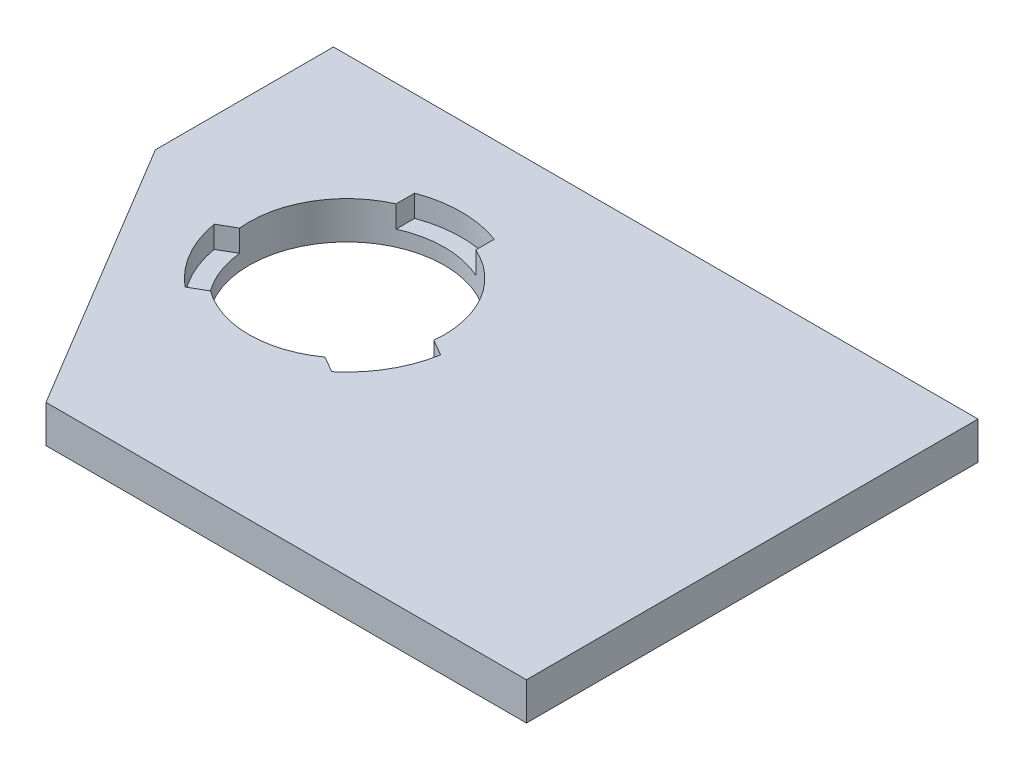
ISO-10303-21;
HEADER;
FILE_DESCRIPTION(('STEP AP214'),'2;1');
FILE_NAME('part.step','',(''),(''),'','','');
FILE_SCHEMA(('AUTOMOTIVE_DESIGN { 1 0 10303 214 1 1 1 1 }'));
ENDSEC;
DATA;
#1=APPLICATION_CONTEXT('core data for automotive mechanical design processes');
#2=APPLICATION_PROTOCOL_DEFINITION('international standard','automotive_design',2000,#1);
#3=PRODUCT_CONTEXT('',#1,'mechanical');
#4=PRODUCT('Part','Part','',(#3));
#5=PRODUCT_RELATED_PRODUCT_CATEGORY('part','',(#4));
#6=PRODUCT_DEFINITION_FORMATION('','',#4);
#7=PRODUCT_DEFINITION_CONTEXT('part definition',#1,'design');
#8=PRODUCT_DEFINITION('design','',#6,#7);
#9=PRODUCT_DEFINITION_SHAPE('','',#8);
#10=(LENGTH_UNIT() NAMED_UNIT(*) SI_UNIT(.MILLI.,.METRE.));
#11=(NAMED_UNIT(*) PLANE_ANGLE_UNIT() SI_UNIT($,.RADIAN.));
#12=(NAMED_UNIT(*) SI_UNIT($,.STERADIAN.) SOLID_ANGLE_UNIT());
#13=UNCERTAINTY_MEASURE_WITH_UNIT(LENGTH_MEASURE(1.E-05),#10,'distance_accuracy_value','');
#14=(GEOMETRIC_REPRESENTATION_CONTEXT(3) GLOBAL_UNCERTAINTY_ASSIGNED_CONTEXT((#13)) GLOBAL_UNIT_ASSIGNED_CONTEXT((#10,
#11,#12)) REPRESENTATION_CONTEXT('',''));
#15=CARTESIAN_POINT('',(0.,0.,0.));
#16=DIRECTION('',(0.,0.,1.));
#17=DIRECTION('',(1.,0.,0.));
#18=AXIS2_PLACEMENT_3D('',#15,#16,#17);
#19=CARTESIAN_POINT('',(0.,4.8,0.));
#20=DIRECTION('',(0.,-1.,0.));
#21=DIRECTION('',(0.,0.,-1.));
#22=AXIS2_PLACEMENT_3D('',#19,#20,#21);
#23=PLANE('',#22);
#24=DIRECTION('',(-1.,0.,0.));
#25=VECTOR('',#24,1.);
#26=CARTESIAN_POINT('',(-20.3661087866109,4.8,-47.6359832635983));
#27=LINE('',#26,#25);
#28=CARTESIAN_POINT('',(144.633891213389,4.8,-47.6359832635983));
#29=VERTEX_POINT('',#28);
#30=CARTESIAN_POINT('',(62.1338912133891,4.8,-47.6359832635983));
#31=VERTEX_POINT('',#30);
#32=EDGE_CURVE('E11',#29,#31,#27,.T.);
#33=ORIENTED_EDGE('',*,*,#32,.T.);
#34=DIRECTION('',(0.,0.,-1.));
#35=VECTOR('',#34,1.);
#36=CARTESIAN_POINT('',(62.1338912133891,4.8,-47.6359832635983));
#37=LINE('',#36,#35);
#38=CARTESIAN_POINT('',(62.1338912133891,4.8,-24.8359832635983));
#39=VERTEX_POINT('',#38);
#40=EDGE_CURVE('E158',#39,#31,#37,.T.);
#41=ORIENTED_EDGE('',*,*,#40,.F.);
#42=DIRECTION('',(0.514495755427527,0.,0.857492925712544));
#43=VECTOR('',#42,1.);
#44=CARTESIAN_POINT('',(83.1338912133891,4.8,10.1640167364017));
#45=LINE('',#44,#43);
#46=CARTESIAN_POINT('',(83.1338912133891,4.8,10.1640167364017));
#47=VERTEX_POINT('',#46);
#48=EDGE_CURVE('E211',#39,#47,#45,.T.);
#49=ORIENTED_EDGE('',*,*,#48,.T.);
#50=DIRECTION('',(-1.,0.,0.));
#51=VECTOR('',#50,1.);
#52=CARTESIAN_POINT('',(144.633891213389,4.8,10.1640167364017));
#53=LINE('',#52,#51);
#54=CARTESIAN_POINT('',(144.633891213389,4.8,10.1640167364017));
#55=VERTEX_POINT('',#54);
#56=EDGE_CURVE('E181',#55,#47,#53,.T.);
#57=ORIENTED_EDGE('',*,*,#56,.F.);
#58=DIRECTION('',(0.,0.,1.));
#59=VECTOR('',#58,1.);
#60=CARTESIAN_POINT('',(144.633891213389,4.8,10.1640167364017));
#61=LINE('',#60,#59);
#62=EDGE_CURVE('E179',#29,#55,#61,.T.);
#63=ORIENTED_EDGE('',*,*,#62,.F.);
#64=EDGE_LOOP('',(#33,#41,#49,#57,#63));
#65=FACE_BOUND('',#64,.T.);
#66=CARTESIAN_POINT('',(88.6338912133891,4.8,-22.8359832635983));
#67=DIRECTION('',(0.,-1.,0.));
#68=DIRECTION('',(0.,0.,1.));
#69=AXIS2_PLACEMENT_3D('',#66,#67,#68);
#70=CIRCLE('',#69,12.5);
#71=CARTESIAN_POINT('',(76.2005719329044,4.8,-21.5465757758243));
#72=VERTEX_POINT('',#71);
#73=CARTESIAN_POINT('',(83.5338912133891,4.8,-34.248257357748));
#74=VERTEX_POINT('',#73);
#75=EDGE_CURVE('E220',#72,#74,#70,.T.);
#76=ORIENTED_EDGE('',*,*,#75,.T.);
#77=DIRECTION('',(0.,0.,1.));
#78=VECTOR('',#77,1.);
#79=CARTESIAN_POINT('',(83.5338912133891,4.8,0.));
#80=LINE('',#79,#78);
#81=CARTESIAN_POINT('',(83.5338912133891,4.8,-36.6229336152896));
#82=VERTEX_POINT('',#81);
#83=EDGE_CURVE('E285',#82,#74,#80,.T.);
#84=ORIENTED_EDGE('',*,*,#83,.F.);
#85=CARTESIAN_POINT('',(88.6338912133891,4.8,-22.8359832635983));
#86=DIRECTION('',(0.,-1.,0.));
#87=DIRECTION('',(0.,0.,1.));
#88=AXIS2_PLACEMENT_3D('',#85,#86,#87);
#89=CIRCLE('',#88,14.7);
#90=CARTESIAN_POINT('',(93.7338912133891,4.8,-36.6229336152896));
#91=VERTEX_POINT('',#90);
#92=EDGE_CURVE('E288',#82,#91,#89,.T.);
#93=ORIENTED_EDGE('',*,*,#92,.T.);
#94=DIRECTION('',(0.,0.,-1.));
#95=VECTOR('',#94,1.);
#96=CARTESIAN_POINT('',(93.7338912133892,4.8,0.));
#97=LINE('',#96,#95);
#98=CARTESIAN_POINT('',(93.7338912133891,4.8,-34.248257357748));
#99=VERTEX_POINT('',#98);
#100=EDGE_CURVE('E260',#99,#91,#97,.T.);
#101=ORIENTED_EDGE('',*,*,#100,.F.);
#102=CARTESIAN_POINT('',(101.067210493874,4.8,-21.5465757758237));
#103=VERTEX_POINT('',#102);
#104=EDGE_CURVE('E218',#99,#103,#70,.T.);
#105=ORIENTED_EDGE('',*,*,#104,.T.);
#106=DIRECTION('',(-0.866025403784443,0.,-0.499999999999992));
#107=VECTOR('',#106,1.);
#108=CARTESIAN_POINT('',(127.797580436767,4.8,-6.11378949375631));
#109=LINE('',#108,#107);
#110=CARTESIAN_POINT('',(103.123740458669,4.8,-20.359237647053));
#111=VERTEX_POINT('',#110);
#112=EDGE_CURVE('E241',#111,#103,#109,.T.);
#113=ORIENTED_EDGE('',*,*,#112,.F.);
#114=CARTESIAN_POINT('',(88.6338912133891,4.8,-22.8359832635983));
#115=DIRECTION('',(0.,-1.,0.));
#116=DIRECTION('',(0.,0.,1.));
#117=AXIS2_PLACEMENT_3D('',#114,#115,#116);
#118=CIRCLE('',#117,14.7);
#119=CARTESIAN_POINT('',(98.0237404586683,4.8,-11.5257785284518));
#120=VERTEX_POINT('',#119);
#121=EDGE_CURVE('E234',#111,#120,#118,.T.);
#122=ORIENTED_EDGE('',*,*,#121,.T.);
#123=DIRECTION('',(0.866025403784444,0.,0.499999999999991));
#124=VECTOR('',#123,1.);
#125=CARTESIAN_POINT('',(122.697580436767,4.8,2.719669624845));
#126=LINE('',#125,#124);
#127=CARTESIAN_POINT('',(95.9672104938735,4.8,-12.7131166572226));
#128=VERTEX_POINT('',#127);
#129=EDGE_CURVE('E238',#128,#120,#126,.T.);
#130=ORIENTED_EDGE('',*,*,#129,.F.);
#131=CARTESIAN_POINT('',(81.3005719329043,4.8,-12.713116657223));
#132=VERTEX_POINT('',#131);
#133=EDGE_CURVE('E215',#128,#132,#70,.T.);
#134=ORIENTED_EDGE('',*,*,#133,.T.);
#135=DIRECTION('',(0.866025403784437,0.,-0.500000000000004));
#136=VECTOR('',#135,1.);
#137=CARTESIAN_POINT('',(108.021038810095,4.8,-28.1401854016414));
#138=LINE('',#137,#136);
#139=CARTESIAN_POINT('',(79.2440419681096,4.8,-11.5257785284522));
#140=VERTEX_POINT('',#139);
#141=EDGE_CURVE('E261',#140,#132,#138,.T.);
#142=ORIENTED_EDGE('',*,*,#141,.F.);
#143=CARTESIAN_POINT('',(88.6338912133891,4.8,-22.8359832635983));
#144=DIRECTION('',(0.,-1.,0.));
#145=DIRECTION('',(0.,0.,1.));
#146=AXIS2_PLACEMENT_3D('',#143,#144,#145);
#147=CIRCLE('',#146,14.7);
#148=CARTESIAN_POINT('',(74.1440419681097,4.8,-20.3592376470535));
#149=VERTEX_POINT('',#148);
#150=EDGE_CURVE('E264',#140,#149,#147,.T.);
#151=ORIENTED_EDGE('',*,*,#150,.T.);
#152=DIRECTION('',(-0.866025403784437,0.,0.500000000000004));
#153=VECTOR('',#152,1.);
#154=CARTESIAN_POINT('',(102.921038810095,4.8,-36.9736445202426));
#155=LINE('',#154,#153);
#156=EDGE_CURVE('E233',#72,#149,#155,.T.);
#157=ORIENTED_EDGE('',*,*,#156,.F.);
#158=EDGE_LOOP('',(#76,#84,#93,#101,#105,#113,#122,#130,#134,#142,#151,#157));
#159=FACE_BOUND('',#158,.T.);
#160=ADVANCED_FACE('F38',(#65,#159),#23,.F.);
#161=CARTESIAN_POINT('',(0.,0.,0.));
#162=DIRECTION('',(0.,-1.,0.));
#163=DIRECTION('',(0.,0.,-1.));
#164=AXIS2_PLACEMENT_3D('',#161,#162,#163);
#165=PLANE('',#164);
#166=DIRECTION('',(0.,0.,1.));
#167=VECTOR('',#166,1.);
#168=CARTESIAN_POINT('',(62.1338912133892,0.,0.));
#169=LINE('',#168,#167);
#170=CARTESIAN_POINT('',(62.1338912133891,0.,-47.6359832635983));
#171=VERTEX_POINT('',#170);
#172=CARTESIAN_POINT('',(62.1338912133891,0.,-24.8359832635983));
#173=VERTEX_POINT('',#172);
#174=EDGE_CURVE('E173',#171,#173,#169,.T.);
#175=ORIENTED_EDGE('',*,*,#174,.F.);
#176=DIRECTION('',(-1.,0.,0.));
#177=VECTOR('',#176,1.);
#178=CARTESIAN_POINT('',(-20.3661087866109,0.,-47.6359832635983));
#179=LINE('',#178,#177);
#180=CARTESIAN_POINT('',(144.633891213389,0.,-47.6359832635983));
#181=VERTEX_POINT('',#180);
#182=EDGE_CURVE('E42',#181,#171,#179,.T.);
#183=ORIENTED_EDGE('',*,*,#182,.F.);
#184=DIRECTION('',(0.,0.,1.));
#185=VECTOR('',#184,1.);
#186=CARTESIAN_POINT('',(144.633891213389,0.,10.1640167364017));
#187=LINE('',#186,#185);
#188=CARTESIAN_POINT('',(144.633891213389,0.,10.1640167364017));
#189=VERTEX_POINT('',#188);
#190=EDGE_CURVE('E188',#181,#189,#187,.T.);
#191=ORIENTED_EDGE('',*,*,#190,.T.);
#192=DIRECTION('',(-1.,0.,0.));
#193=VECTOR('',#192,1.);
#194=CARTESIAN_POINT('',(144.633891213389,0.,10.1640167364017));
#195=LINE('',#194,#193);
#196=CARTESIAN_POINT('',(83.1338912133891,0.,10.1640167364017));
#197=VERTEX_POINT('',#196);
#198=EDGE_CURVE('E183',#189,#197,#195,.T.);
#199=ORIENTED_EDGE('',*,*,#198,.T.);
#200=DIRECTION('',(0.514495755427527,0.,0.857492925712544));
#201=VECTOR('',#200,1.);
#202=CARTESIAN_POINT('',(83.1338912133891,0.,10.1640167364017));
#203=LINE('',#202,#201);
#204=EDGE_CURVE('E210',#173,#197,#203,.T.);
#205=ORIENTED_EDGE('',*,*,#204,.F.);
#206=EDGE_LOOP('',(#175,#183,#191,#199,#205));
#207=FACE_BOUND('',#206,.T.);
#208=CARTESIAN_POINT('',(88.6338912133891,0.,-22.8359832635983));
#209=DIRECTION('',(0.,-1.,0.));
#210=DIRECTION('',(0.,0.,1.));
#211=AXIS2_PLACEMENT_3D('',#208,#209,#210);
#212=CIRCLE('',#211,12.5);
#213=CARTESIAN_POINT('',(88.6338912133891,0.,-10.3359832635983));
#214=VERTEX_POINT('',#213);
#215=EDGE_CURVE('E213',#214,#214,#212,.T.);
#216=ORIENTED_EDGE('',*,*,#215,.F.);
#217=EDGE_LOOP('',(#216));
#218=FACE_BOUND('',#217,.T.);
#219=ADVANCED_FACE('F203',(#207,#218),#165,.T.);
#220=CARTESIAN_POINT('',(144.633891213389,4.8,10.1640167364017));
#221=DIRECTION('',(0.,0.,1.));
#222=DIRECTION('',(1.,0.,0.));
#223=AXIS2_PLACEMENT_3D('',#220,#221,#222);
#224=PLANE('',#223);
#225=ORIENTED_EDGE('',*,*,#56,.T.);
#226=DIRECTION('',(0.,1.,0.));
#227=VECTOR('',#226,1.);
#228=CARTESIAN_POINT('',(83.1338912133891,0.,10.1640167364017));
#229=LINE('',#228,#227);
#230=EDGE_CURVE('E191',#197,#47,#229,.T.);
#231=ORIENTED_EDGE('',*,*,#230,.F.);
#232=ORIENTED_EDGE('',*,*,#198,.F.);
#233=DIRECTION('',(0.,-1.,0.));
#234=VECTOR('',#233,1.);
#235=CARTESIAN_POINT('',(144.633891213389,4.8,10.1640167364017));
#236=LINE('',#235,#234);
#237=EDGE_CURVE('E185',#55,#189,#236,.T.);
#238=ORIENTED_EDGE('',*,*,#237,.F.);
#239=EDGE_LOOP('',(#225,#231,#232,#238));
#240=FACE_BOUND('',#239,.T.);
#241=ADVANCED_FACE('F208',(#240),#224,.T.);
#242=CARTESIAN_POINT('',(-20.3661087866109,4.8,-47.6359832635983));
#243=DIRECTION('',(0.,0.,1.));
#244=DIRECTION('',(1.,0.,0.));
#245=AXIS2_PLACEMENT_3D('',#242,#243,#244);
#246=PLANE('',#245);
#247=ORIENTED_EDGE('',*,*,#182,.T.);
#248=DIRECTION('',(0.,1.,0.));
#249=VECTOR('',#248,1.);
#250=CARTESIAN_POINT('',(62.1338912133891,-5.2,-47.6359832635983));
#251=LINE('',#250,#249);
#252=EDGE_CURVE('E161',#171,#31,#251,.T.);
#253=ORIENTED_EDGE('',*,*,#252,.T.);
#254=ORIENTED_EDGE('',*,*,#32,.F.);
#255=DIRECTION('',(0.,-1.,0.));
#256=VECTOR('',#255,1.);
#257=CARTESIAN_POINT('',(144.633891213389,4.8,-47.6359832635983));
#258=LINE('',#257,#256);
#259=EDGE_CURVE('E197',#29,#181,#258,.T.);
#260=ORIENTED_EDGE('',*,*,#259,.T.);
#261=EDGE_LOOP('',(#247,#253,#254,#260));
#262=FACE_BOUND('',#261,.T.);
#263=ADVANCED_FACE('F40',(#262),#246,.F.);
#264=CARTESIAN_POINT('',(144.633891213389,4.8,10.1640167364017));
#265=DIRECTION('',(1.,0.,0.));
#266=DIRECTION('',(0.,0.,-1.));
#267=AXIS2_PLACEMENT_3D('',#264,#265,#266);
#268=PLANE('',#267);
#269=ORIENTED_EDGE('',*,*,#190,.F.);
#270=ORIENTED_EDGE('',*,*,#259,.F.);
#271=ORIENTED_EDGE('',*,*,#62,.T.);
#272=ORIENTED_EDGE('',*,*,#237,.T.);
#273=EDGE_LOOP('',(#269,#270,#271,#272));
#274=FACE_BOUND('',#273,.T.);
#275=ADVANCED_FACE('F200',(#274),#268,.T.);
#276=CARTESIAN_POINT('',(83.1338912133891,0.,10.1640167364017));
#277=DIRECTION('',(-0.857492925712544,0.,0.514495755427527));
#278=DIRECTION('',(0.514495755427527,0.,0.857492925712544));
#279=AXIS2_PLACEMENT_3D('',#276,#277,#278);
#280=PLANE('',#279);
#281=ORIENTED_EDGE('',*,*,#48,.F.);
#282=DIRECTION('',(0.,1.,0.));
#283=VECTOR('',#282,1.);
#284=CARTESIAN_POINT('',(62.1338912133891,0.,-24.8359832635983));
#285=LINE('',#284,#283);
#286=EDGE_CURVE('E164',#173,#39,#285,.T.);
#287=ORIENTED_EDGE('',*,*,#286,.F.);
#288=ORIENTED_EDGE('',*,*,#204,.T.);
#289=ORIENTED_EDGE('',*,*,#230,.T.);
#290=EDGE_LOOP('',(#281,#287,#288,#289));
#291=FACE_BOUND('',#290,.T.);
#292=ADVANCED_FACE('F301',(#291),#280,.T.);
#293=CARTESIAN_POINT('',(88.6338912133891,0.,-22.8359832635983));
#294=DIRECTION('',(0.,1.,0.));
#295=DIRECTION('',(0.,0.,1.));
#296=AXIS2_PLACEMENT_3D('',#293,#294,#295);
#297=CYLINDRICAL_SURFACE('',#296,12.5);
#298=DIRECTION('',(0.,1.,0.));
#299=VECTOR('',#298,1.);
#300=CARTESIAN_POINT('',(83.5338912133891,2.,-34.248257357748));
#301=LINE('',#300,#299);
#302=CARTESIAN_POINT('',(83.5338912133891,2.,-34.248257357748));
#303=VERTEX_POINT('',#302);
#304=EDGE_CURVE('E219',#303,#74,#301,.T.);
#305=ORIENTED_EDGE('',*,*,#304,.T.);
#306=ORIENTED_EDGE('',*,*,#75,.F.);
#307=DIRECTION('',(0.,1.,0.));
#308=VECTOR('',#307,1.);
#309=CARTESIAN_POINT('',(76.2005719329044,2.,-21.5465757758243));
#310=LINE('',#309,#308);
#311=CARTESIAN_POINT('',(76.2005719329044,2.,-21.5465757758243));
#312=VERTEX_POINT('',#311);
#313=EDGE_CURVE('E251',#312,#72,#310,.T.);
#314=ORIENTED_EDGE('',*,*,#313,.F.);
#315=CARTESIAN_POINT('',(88.6338912133891,2.,-22.8359832635983));
#316=DIRECTION('',(0.,-1.,0.));
#317=DIRECTION('',(0.,0.,1.));
#318=AXIS2_PLACEMENT_3D('',#315,#316,#317);
#319=CIRCLE('',#318,12.5);
#320=CARTESIAN_POINT('',(81.3005719329043,2.,-12.713116657223));
#321=VERTEX_POINT('',#320);
#322=EDGE_CURVE('E263',#312,#321,#319,.F.);
#323=ORIENTED_EDGE('',*,*,#322,.T.);
#324=DIRECTION('',(0.,1.,0.));
#325=VECTOR('',#324,1.);
#326=CARTESIAN_POINT('',(81.3005719329043,2.,-12.713116657223));
#327=LINE('',#326,#325);
#328=EDGE_CURVE('E257',#321,#132,#327,.T.);
#329=ORIENTED_EDGE('',*,*,#328,.T.);
#330=ORIENTED_EDGE('',*,*,#133,.F.);
#331=DIRECTION('',(0.,1.,0.));
#332=VECTOR('',#331,1.);
#333=CARTESIAN_POINT('',(95.9672104938735,2.,-12.7131166572226));
#334=LINE('',#333,#332);
#335=CARTESIAN_POINT('',(95.9672104938735,2.,-12.7131166572226));
#336=VERTEX_POINT('',#335);
#337=EDGE_CURVE('E226',#336,#128,#334,.T.);
#338=ORIENTED_EDGE('',*,*,#337,.F.);
#339=CARTESIAN_POINT('',(88.6338912133891,2.,-22.8359832635983));
#340=DIRECTION('',(0.,-1.,0.));
#341=DIRECTION('',(0.,0.,1.));
#342=AXIS2_PLACEMENT_3D('',#339,#340,#341);
#343=CIRCLE('',#342,12.5);
#344=CARTESIAN_POINT('',(101.067210493874,2.,-21.5465757758237));
#345=VERTEX_POINT('',#344);
#346=EDGE_CURVE('E247',#336,#345,#343,.F.);
#347=ORIENTED_EDGE('',*,*,#346,.T.);
#348=DIRECTION('',(0.,1.,0.));
#349=VECTOR('',#348,1.);
#350=CARTESIAN_POINT('',(101.067210493874,2.,-21.5465757758237));
#351=LINE('',#350,#349);
#352=EDGE_CURVE('E223',#345,#103,#351,.T.);
#353=ORIENTED_EDGE('',*,*,#352,.T.);
#354=ORIENTED_EDGE('',*,*,#104,.F.);
#355=DIRECTION('',(0.,1.,0.));
#356=VECTOR('',#355,1.);
#357=CARTESIAN_POINT('',(93.7338912133891,2.,-34.248257357748));
#358=LINE('',#357,#356);
#359=CARTESIAN_POINT('',(93.7338912133891,2.,-34.248257357748));
#360=VERTEX_POINT('',#359);
#361=EDGE_CURVE('E277',#360,#99,#358,.T.);
#362=ORIENTED_EDGE('',*,*,#361,.F.);
#363=CARTESIAN_POINT('',(88.6338912133891,2.,-22.8359832635983));
#364=DIRECTION('',(0.,-1.,0.));
#365=DIRECTION('',(0.,0.,1.));
#366=AXIS2_PLACEMENT_3D('',#363,#364,#365);
#367=CIRCLE('',#366,12.5);
#368=EDGE_CURVE('E287',#360,#303,#367,.F.);
#369=ORIENTED_EDGE('',*,*,#368,.T.);
#370=EDGE_LOOP('',(#305,#306,#314,#323,#329,#330,#338,#347,#353,#354,#362,#369));
#371=FACE_BOUND('',#370,.T.);
#372=ORIENTED_EDGE('',*,*,#215,.T.);
#373=EDGE_LOOP('',(#372));
#374=FACE_BOUND('',#373,.T.);
#375=ADVANCED_FACE('F303',(#371,#374),#297,.F.);
#376=CARTESIAN_POINT('',(127.797580436767,2.,-6.11378949375631));
#377=DIRECTION('',(0.499999999999992,0.,-0.866025403784443));
#378=DIRECTION('',(-0.866025403784443,0.,-0.499999999999992));
#379=AXIS2_PLACEMENT_3D('',#376,#377,#378);
#380=PLANE('',#379);
#381=ORIENTED_EDGE('',*,*,#112,.T.);
#382=ORIENTED_EDGE('',*,*,#352,.F.);
#383=DIRECTION('',(-0.866025403784443,0.,-0.499999999999992));
#384=VECTOR('',#383,1.);
#385=CARTESIAN_POINT('',(127.797580436767,2.,-6.11378949375631));
#386=LINE('',#385,#384);
#387=CARTESIAN_POINT('',(103.123740458669,2.,-20.359237647053));
#388=VERTEX_POINT('',#387);
#389=EDGE_CURVE('E237',#388,#345,#386,.T.);
#390=ORIENTED_EDGE('',*,*,#389,.F.);
#391=DIRECTION('',(0.,1.,0.));
#392=VECTOR('',#391,1.);
#393=CARTESIAN_POINT('',(103.123740458669,2.,-20.359237647053));
#394=LINE('',#393,#392);
#395=EDGE_CURVE('E231',#388,#111,#394,.T.);
#396=ORIENTED_EDGE('',*,*,#395,.T.);
#397=EDGE_LOOP('',(#381,#382,#390,#396));
#398=FACE_BOUND('',#397,.T.);
#399=ADVANCED_FACE('F309',(#398),#380,.F.);
#400=CARTESIAN_POINT('',(88.6338912133891,2.,-22.8359832635983));
#401=DIRECTION('',(0.,1.,0.));
#402=DIRECTION('',(0.,0.,1.));
#403=AXIS2_PLACEMENT_3D('',#400,#401,#402);
#404=CYLINDRICAL_SURFACE('',#403,14.7);
#405=ORIENTED_EDGE('',*,*,#121,.F.);
#406=ORIENTED_EDGE('',*,*,#395,.F.);
#407=CARTESIAN_POINT('',(88.6338912133891,2.,-22.8359832635983));
#408=DIRECTION('',(0.,-1.,0.));
#409=DIRECTION('',(0.,0.,1.));
#410=AXIS2_PLACEMENT_3D('',#407,#408,#409);
#411=CIRCLE('',#410,14.7);
#412=CARTESIAN_POINT('',(98.0237404586683,2.,-11.5257785284518));
#413=VERTEX_POINT('',#412);
#414=EDGE_CURVE('E227',#388,#413,#411,.T.);
#415=ORIENTED_EDGE('',*,*,#414,.T.);
#416=DIRECTION('',(0.,1.,0.));
#417=VECTOR('',#416,1.);
#418=CARTESIAN_POINT('',(98.0237404586683,2.,-11.5257785284518));
#419=LINE('',#418,#417);
#420=EDGE_CURVE('E229',#413,#120,#419,.T.);
#421=ORIENTED_EDGE('',*,*,#420,.T.);
#422=EDGE_LOOP('',(#405,#406,#415,#421));
#423=FACE_BOUND('',#422,.T.);
#424=ADVANCED_FACE('F348',(#423),#404,.F.);
#425=CARTESIAN_POINT('',(122.697580436767,2.,2.719669624845));
#426=DIRECTION('',(-0.499999999999991,0.,0.866025403784444));
#427=DIRECTION('',(0.866025403784444,0.,0.499999999999991));
#428=AXIS2_PLACEMENT_3D('',#425,#426,#427);
#429=PLANE('',#428);
#430=ORIENTED_EDGE('',*,*,#129,.T.);
#431=ORIENTED_EDGE('',*,*,#420,.F.);
#432=DIRECTION('',(0.866025403784444,0.,0.499999999999991));
#433=VECTOR('',#432,1.);
#434=CARTESIAN_POINT('',(122.697580436767,2.,2.719669624845));
#435=LINE('',#434,#433);
#436=EDGE_CURVE('E244',#336,#413,#435,.T.);
#437=ORIENTED_EDGE('',*,*,#436,.F.);
#438=ORIENTED_EDGE('',*,*,#337,.T.);
#439=EDGE_LOOP('',(#430,#431,#437,#438));
#440=FACE_BOUND('',#439,.T.);
#441=ADVANCED_FACE('F358',(#440),#429,.F.);
#442=CARTESIAN_POINT('',(124.267782426778,2.,0.));
#443=DIRECTION('',(0.,1.,0.));
#444=DIRECTION('',(0.,0.,1.));
#445=AXIS2_PLACEMENT_3D('',#442,#443,#444);
#446=PLANE('',#445);
#447=ORIENTED_EDGE('',*,*,#389,.T.);
#448=ORIENTED_EDGE('',*,*,#346,.F.);
#449=ORIENTED_EDGE('',*,*,#436,.T.);
#450=ORIENTED_EDGE('',*,*,#414,.F.);
#451=EDGE_LOOP('',(#447,#448,#449,#450));
#452=FACE_BOUND('',#451,.T.);
#453=ADVANCED_FACE('F368',(#452),#446,.T.);
#454=CARTESIAN_POINT('',(108.021038810095,2.,-28.1401854016414));
#455=DIRECTION('',(0.500000000000004,0.,0.866025403784436));
#456=DIRECTION('',(0.866025403784436,0.,-0.500000000000004));
#457=AXIS2_PLACEMENT_3D('',#454,#455,#456);
#458=PLANE('',#457);
#459=ORIENTED_EDGE('',*,*,#141,.T.);
#460=ORIENTED_EDGE('',*,*,#328,.F.);
#461=DIRECTION('',(0.866025403784437,0.,-0.500000000000004));
#462=VECTOR('',#461,1.);
#463=CARTESIAN_POINT('',(108.021038810095,2.,-28.1401854016414));
#464=LINE('',#463,#462);
#465=CARTESIAN_POINT('',(79.2440419681096,2.,-11.5257785284522));
#466=VERTEX_POINT('',#465);
#467=EDGE_CURVE('E61',#466,#321,#464,.T.);
#468=ORIENTED_EDGE('',*,*,#467,.F.);
#469=DIRECTION('',(0.,1.,0.));
#470=VECTOR('',#469,1.);
#471=CARTESIAN_POINT('',(79.2440419681096,2.,-11.5257785284522));
#472=LINE('',#471,#470);
#473=EDGE_CURVE('E255',#466,#140,#472,.T.);
#474=ORIENTED_EDGE('',*,*,#473,.T.);
#475=EDGE_LOOP('',(#459,#460,#468,#474));
#476=FACE_BOUND('',#475,.T.);
#477=ADVANCED_FACE('F379',(#476),#458,.F.);
#478=CARTESIAN_POINT('',(88.6338912133891,2.,-22.8359832635983));
#479=DIRECTION('',(0.,1.,0.));
#480=DIRECTION('',(0.,0.,1.));
#481=AXIS2_PLACEMENT_3D('',#478,#479,#480);
#482=CYLINDRICAL_SURFACE('',#481,14.7);
#483=ORIENTED_EDGE('',*,*,#150,.F.);
#484=ORIENTED_EDGE('',*,*,#473,.F.);
#485=CARTESIAN_POINT('',(88.6338912133891,2.,-22.8359832635983));
#486=DIRECTION('',(0.,-1.,0.));
#487=DIRECTION('',(0.,0.,1.));
#488=AXIS2_PLACEMENT_3D('',#485,#486,#487);
#489=CIRCLE('',#488,14.7);
#490=CARTESIAN_POINT('',(74.1440419681097,2.,-20.3592376470535));
#491=VERTEX_POINT('',#490);
#492=EDGE_CURVE('E270',#466,#491,#489,.T.);
#493=ORIENTED_EDGE('',*,*,#492,.T.);
#494=DIRECTION('',(0.,1.,0.));
#495=VECTOR('',#494,1.);
#496=CARTESIAN_POINT('',(74.1440419681097,2.,-20.3592376470535));
#497=LINE('',#496,#495);
#498=EDGE_CURVE('E253',#491,#149,#497,.T.);
#499=ORIENTED_EDGE('',*,*,#498,.T.);
#500=EDGE_LOOP('',(#483,#484,#493,#499));
#501=FACE_BOUND('',#500,.T.);
#502=ADVANCED_FACE('F389',(#501),#482,.F.);
#503=CARTESIAN_POINT('',(102.921038810095,2.,-36.9736445202426));
#504=DIRECTION('',(-0.500000000000004,0.,-0.866025403784437));
#505=DIRECTION('',(-0.866025403784437,0.,0.500000000000004));
#506=AXIS2_PLACEMENT_3D('',#503,#504,#505);
#507=PLANE('',#506);
#508=ORIENTED_EDGE('',*,*,#156,.T.);
#509=ORIENTED_EDGE('',*,*,#498,.F.);
#510=DIRECTION('',(-0.866025403784437,0.,0.500000000000004));
#511=VECTOR('',#510,1.);
#512=CARTESIAN_POINT('',(102.921038810095,2.,-36.9736445202426));
#513=LINE('',#512,#511);
#514=EDGE_CURVE('E272',#312,#491,#513,.T.);
#515=ORIENTED_EDGE('',*,*,#514,.F.);
#516=ORIENTED_EDGE('',*,*,#313,.T.);
#517=EDGE_LOOP('',(#508,#509,#515,#516));
#518=FACE_BOUND('',#517,.T.);
#519=ADVANCED_FACE('F399',(#518),#507,.F.);
#520=CARTESIAN_POINT('',(124.267782426778,2.,0.));
#521=DIRECTION('',(0.,1.,0.));
#522=DIRECTION('',(0.,0.,1.));
#523=AXIS2_PLACEMENT_3D('',#520,#521,#522);
#524=PLANE('',#523);
#525=ORIENTED_EDGE('',*,*,#322,.F.);
#526=ORIENTED_EDGE('',*,*,#514,.T.);
#527=ORIENTED_EDGE('',*,*,#492,.F.);
#528=ORIENTED_EDGE('',*,*,#467,.T.);
#529=EDGE_LOOP('',(#525,#526,#527,#528));
#530=FACE_BOUND('',#529,.T.);
#531=ADVANCED_FACE('F409',(#530),#524,.T.);
#532=CARTESIAN_POINT('',(83.5338912133891,2.,0.));
#533=DIRECTION('',(-1.,0.,0.));
#534=DIRECTION('',(0.,0.,1.));
#535=AXIS2_PLACEMENT_3D('',#532,#533,#534);
#536=PLANE('',#535);
#537=ORIENTED_EDGE('',*,*,#83,.T.);
#538=ORIENTED_EDGE('',*,*,#304,.F.);
#539=DIRECTION('',(0.,0.,1.));
#540=VECTOR('',#539,1.);
#541=CARTESIAN_POINT('',(83.5338912133891,2.,0.));
#542=LINE('',#541,#540);
#543=CARTESIAN_POINT('',(83.5338912133891,2.,-36.6229336152896));
#544=VERTEX_POINT('',#543);
#545=EDGE_CURVE('E53',#544,#303,#542,.T.);
#546=ORIENTED_EDGE('',*,*,#545,.F.);
#547=DIRECTION('',(0.,1.,0.));
#548=VECTOR('',#547,1.);
#549=CARTESIAN_POINT('',(83.5338912133891,2.,-36.6229336152896));
#550=LINE('',#549,#548);
#551=EDGE_CURVE('E281',#544,#82,#550,.T.);
#552=ORIENTED_EDGE('',*,*,#551,.T.);
#553=EDGE_LOOP('',(#537,#538,#546,#552));
#554=FACE_BOUND('',#553,.T.);
#555=ADVANCED_FACE('F420',(#554),#536,.F.);
#556=CARTESIAN_POINT('',(88.6338912133891,2.,-22.8359832635983));
#557=DIRECTION('',(0.,1.,0.));
#558=DIRECTION('',(0.,0.,1.));
#559=AXIS2_PLACEMENT_3D('',#556,#557,#558);
#560=CYLINDRICAL_SURFACE('',#559,14.7);
#561=ORIENTED_EDGE('',*,*,#92,.F.);
#562=ORIENTED_EDGE('',*,*,#551,.F.);
#563=CARTESIAN_POINT('',(88.6338912133891,2.,-22.8359832635983));
#564=DIRECTION('',(0.,-1.,0.));
#565=DIRECTION('',(0.,0.,1.));
#566=AXIS2_PLACEMENT_3D('',#563,#564,#565);
#567=CIRCLE('',#566,14.7);
#568=CARTESIAN_POINT('',(93.7338912133891,2.,-36.6229336152896));
#569=VERTEX_POINT('',#568);
#570=EDGE_CURVE('E294',#544,#569,#567,.T.);
#571=ORIENTED_EDGE('',*,*,#570,.T.);
#572=DIRECTION('',(0.,1.,0.));
#573=VECTOR('',#572,1.);
#574=CARTESIAN_POINT('',(93.7338912133891,2.,-36.6229336152896));
#575=LINE('',#574,#573);
#576=EDGE_CURVE('E279',#569,#91,#575,.T.);
#577=ORIENTED_EDGE('',*,*,#576,.T.);
#578=EDGE_LOOP('',(#561,#562,#571,#577));
#579=FACE_BOUND('',#578,.T.);
#580=ADVANCED_FACE('F429',(#579),#560,.F.);
#581=CARTESIAN_POINT('',(93.7338912133892,2.,0.));
#582=DIRECTION('',(1.,0.,0.));
#583=DIRECTION('',(0.,0.,-1.));
#584=AXIS2_PLACEMENT_3D('',#581,#582,#583);
#585=PLANE('',#584);
#586=ORIENTED_EDGE('',*,*,#100,.T.);
#587=ORIENTED_EDGE('',*,*,#576,.F.);
#588=DIRECTION('',(0.,0.,-1.));
#589=VECTOR('',#588,1.);
#590=CARTESIAN_POINT('',(93.7338912133892,2.,0.));
#591=LINE('',#590,#589);
#592=EDGE_CURVE('E296',#360,#569,#591,.T.);
#593=ORIENTED_EDGE('',*,*,#592,.F.);
#594=ORIENTED_EDGE('',*,*,#361,.T.);
#595=EDGE_LOOP('',(#586,#587,#593,#594));
#596=FACE_BOUND('',#595,.T.);
#597=ADVANCED_FACE('F439',(#596),#585,.F.);
#598=CARTESIAN_POINT('',(124.267782426778,2.,0.));
#599=DIRECTION('',(0.,1.,0.));
#600=DIRECTION('',(0.,0.,1.));
#601=AXIS2_PLACEMENT_3D('',#598,#599,#600);
#602=PLANE('',#601);
#603=ORIENTED_EDGE('',*,*,#368,.F.);
#604=ORIENTED_EDGE('',*,*,#592,.T.);
#605=ORIENTED_EDGE('',*,*,#570,.F.);
#606=ORIENTED_EDGE('',*,*,#545,.T.);
#607=EDGE_LOOP('',(#603,#604,#605,#606));
#608=FACE_BOUND('',#607,.T.);
#609=ADVANCED_FACE('F449',(#608),#602,.T.);
#610=CARTESIAN_POINT('',(62.1338912133891,-5.2,-47.6359832635983));
#611=DIRECTION('',(1.,0.,0.));
#612=DIRECTION('',(0.,0.,-1.));
#613=AXIS2_PLACEMENT_3D('',#610,#611,#612);
#614=PLANE('',#613);
#615=ORIENTED_EDGE('',*,*,#174,.T.);
#616=ORIENTED_EDGE('',*,*,#286,.T.);
#617=ORIENTED_EDGE('',*,*,#40,.T.);
#618=ORIENTED_EDGE('',*,*,#252,.F.);
#619=EDGE_LOOP('',(#615,#616,#617,#618));
#620=FACE_BOUND('',#619,.T.);
#621=ADVANCED_FACE('F160',(#620),#614,.F.);
#622=CLOSED_SHELL('',(#160,#219,#241,#263,#275,#292,#375,#399,#424,#441,#453,#477,#502,#519,
#531,#555,#580,#597,#609,#621));
#623=MANIFOLD_SOLID_BREP('B2',#622);
#624=ADVANCED_BREP_SHAPE_REPRESENTATION('',(#18,#623),#14);
#625=SHAPE_DEFINITION_REPRESENTATION(#9,#624);
ENDSEC;
END-ISO-10303-21;
